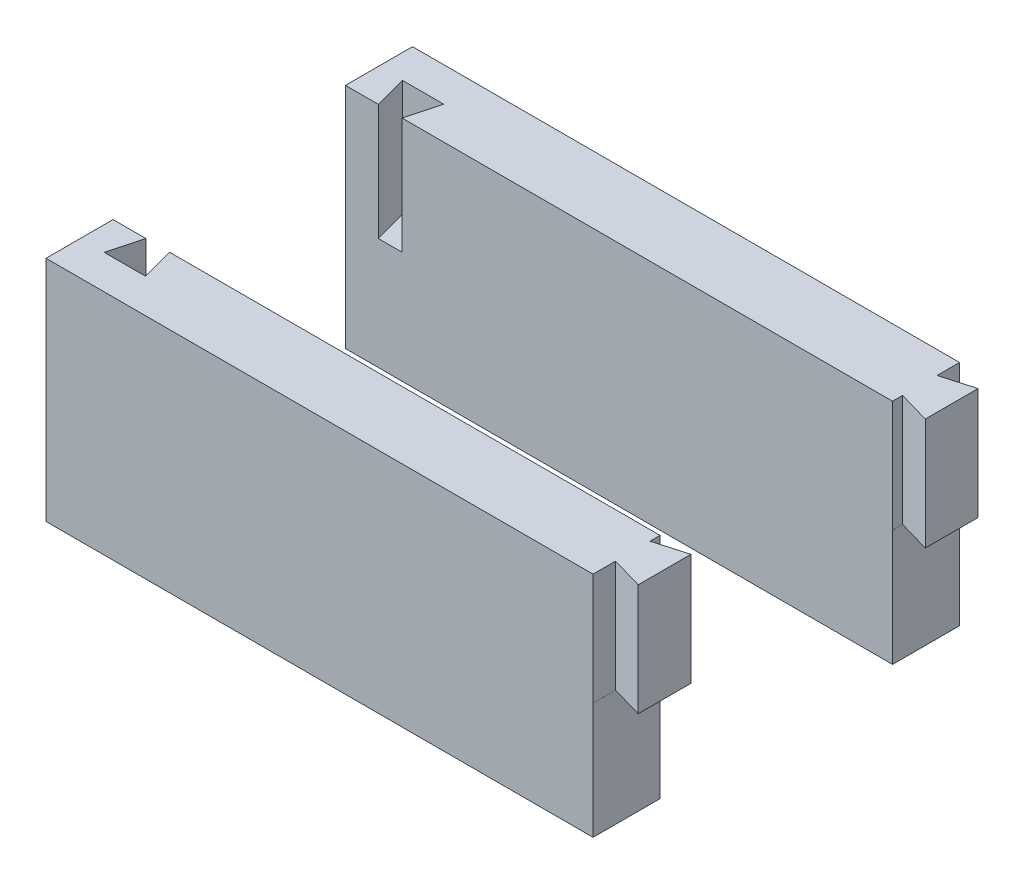
ISO-10303-21;
HEADER;
FILE_DESCRIPTION(('STEP AP214'),'2;1');
FILE_NAME('part.step','',(''),(''),'','','');
FILE_SCHEMA(('AUTOMOTIVE_DESIGN { 1 0 10303 214 1 1 1 1 }'));
ENDSEC;
DATA;
#1=APPLICATION_CONTEXT('core data for automotive mechanical design processes');
#2=APPLICATION_PROTOCOL_DEFINITION('international standard','automotive_design',2000,#1);
#3=PRODUCT_CONTEXT('',#1,'mechanical');
#4=PRODUCT('Part','Part','',(#3));
#5=PRODUCT_RELATED_PRODUCT_CATEGORY('part','',(#4));
#6=PRODUCT_DEFINITION_FORMATION('','',#4);
#7=PRODUCT_DEFINITION_CONTEXT('part definition',#1,'design');
#8=PRODUCT_DEFINITION('design','',#6,#7);
#9=PRODUCT_DEFINITION_SHAPE('','',#8);
#10=(LENGTH_UNIT() NAMED_UNIT(*) SI_UNIT(.MILLI.,.METRE.));
#11=(NAMED_UNIT(*) PLANE_ANGLE_UNIT() SI_UNIT($,.RADIAN.));
#12=(NAMED_UNIT(*) SI_UNIT($,.STERADIAN.) SOLID_ANGLE_UNIT());
#13=UNCERTAINTY_MEASURE_WITH_UNIT(LENGTH_MEASURE(1.E-05),#10,'distance_accuracy_value','');
#14=(GEOMETRIC_REPRESENTATION_CONTEXT(3) GLOBAL_UNCERTAINTY_ASSIGNED_CONTEXT((#13)) GLOBAL_UNIT_ASSIGNED_CONTEXT((#10,
#11,#12)) REPRESENTATION_CONTEXT('',''));
#15=CARTESIAN_POINT('',(0.,0.,0.));
#16=DIRECTION('',(0.,0.,1.));
#17=DIRECTION('',(1.,0.,0.));
#18=AXIS2_PLACEMENT_3D('',#15,#16,#17);
#19=CARTESIAN_POINT('',(-60.9366197183099,28.612676056338,-67.));
#20=DIRECTION('',(1.,0.,0.));
#21=DIRECTION('',(0.,0.,1.));
#22=AXIS2_PLACEMENT_3D('',#19,#20,#21);
#23=PLANE('',#22);
#24=DIRECTION('',(0.,-1.,0.));
#25=VECTOR('',#24,1.);
#26=CARTESIAN_POINT('',(-60.9366197183099,28.612676056338,-52.));
#27=LINE('',#26,#25);
#28=CARTESIAN_POINT('',(-60.9366197183099,28.612676056338,-52.));
#29=VERTEX_POINT('',#28);
#30=CARTESIAN_POINT('',(-60.9366197183099,-22.387323943662,-52.));
#31=VERTEX_POINT('',#30);
#32=EDGE_CURVE('E283',#29,#31,#27,.T.);
#33=ORIENTED_EDGE('',*,*,#32,.F.);
#34=DIRECTION('',(0.,0.,1.));
#35=VECTOR('',#34,1.);
#36=CARTESIAN_POINT('',(-60.9366197183099,28.612676056338,-67.));
#37=LINE('',#36,#35);
#38=CARTESIAN_POINT('',(-60.9366197183099,28.612676056338,-67.));
#39=VERTEX_POINT('',#38);
#40=EDGE_CURVE('E299',#39,#29,#37,.T.);
#41=ORIENTED_EDGE('',*,*,#40,.F.);
#42=DIRECTION('',(0.,-1.,0.));
#43=VECTOR('',#42,1.);
#44=CARTESIAN_POINT('',(-60.9366197183099,28.612676056338,-67.));
#45=LINE('',#44,#43);
#46=CARTESIAN_POINT('',(-60.9366197183099,-22.387323943662,-67.));
#47=VERTEX_POINT('',#46);
#48=EDGE_CURVE('E287',#39,#47,#45,.T.);
#49=ORIENTED_EDGE('',*,*,#48,.T.);
#50=DIRECTION('',(0.,0.,1.));
#51=VECTOR('',#50,1.);
#52=CARTESIAN_POINT('',(-60.9366197183099,-22.387323943662,-67.));
#53=LINE('',#52,#51);
#54=EDGE_CURVE('E12',#47,#31,#53,.T.);
#55=ORIENTED_EDGE('',*,*,#54,.T.);
#56=EDGE_LOOP('',(#33,#41,#49,#55));
#57=FACE_BOUND('',#56,.T.);
#58=ADVANCED_FACE('F54',(#57),#23,.F.);
#59=CARTESIAN_POINT('',(-60.9366197183099,-22.387323943662,-67.));
#60=DIRECTION('',(0.,1.,0.));
#61=DIRECTION('',(0.,0.,-1.));
#62=AXIS2_PLACEMENT_3D('',#59,#60,#61);
#63=PLANE('',#62);
#64=DIRECTION('',(1.,0.,0.));
#65=VECTOR('',#64,1.);
#66=CARTESIAN_POINT('',(-60.9366197183099,-22.387323943662,-52.));
#67=LINE('',#66,#65);
#68=CARTESIAN_POINT('',(61.4533802816902,-22.387323943662,-52.));
#69=VERTEX_POINT('',#68);
#70=EDGE_CURVE('E179',#31,#69,#67,.T.);
#71=ORIENTED_EDGE('',*,*,#70,.F.);
#72=ORIENTED_EDGE('',*,*,#54,.F.);
#73=DIRECTION('',(1.,0.,0.));
#74=VECTOR('',#73,1.);
#75=CARTESIAN_POINT('',(-60.9366197183099,-22.387323943662,-67.));
#76=LINE('',#75,#74);
#77=CARTESIAN_POINT('',(61.4533802816902,-22.387323943662,-67.));
#78=VERTEX_POINT('',#77);
#79=EDGE_CURVE('E291',#47,#78,#76,.T.);
#80=ORIENTED_EDGE('',*,*,#79,.T.);
#81=DIRECTION('',(0.,0.,1.));
#82=VECTOR('',#81,1.);
#83=CARTESIAN_POINT('',(61.4533802816902,-22.387323943662,-52.));
#84=LINE('',#83,#82);
#85=EDGE_CURVE('E170',#78,#69,#84,.T.);
#86=ORIENTED_EDGE('',*,*,#85,.T.);
#87=EDGE_LOOP('',(#71,#72,#80,#86));
#88=FACE_BOUND('',#87,.T.);
#89=ADVANCED_FACE('F359',(#88),#63,.F.);
#90=CARTESIAN_POINT('',(68.5633802816901,28.612676056338,-67.));
#91=DIRECTION('',(-1.,0.,0.));
#92=DIRECTION('',(0.,0.,-1.));
#93=AXIS2_PLACEMENT_3D('',#90,#91,#92);
#94=PLANE('',#93);
#95=DIRECTION('',(0.,1.,0.));
#96=VECTOR('',#95,1.);
#97=CARTESIAN_POINT('',(68.5633802816901,3.61267605633802,-64.0102835669542));
#98=LINE('',#97,#96);
#99=CARTESIAN_POINT('',(68.5633802816901,3.61267605633802,-64.0102835669542));
#100=VERTEX_POINT('',#99);
#101=CARTESIAN_POINT('',(68.5633802816901,28.612676056338,-64.0102835669542));
#102=VERTEX_POINT('',#101);
#103=EDGE_CURVE('E215',#100,#102,#98,.T.);
#104=ORIENTED_EDGE('',*,*,#103,.T.);
#105=DIRECTION('',(0.,0.,1.));
#106=VECTOR('',#105,1.);
#107=CARTESIAN_POINT('',(68.5633802816901,28.612676056338,-67.));
#108=LINE('',#107,#106);
#109=CARTESIAN_POINT('',(68.5633802816901,28.612676056338,-52.2102835669542));
#110=VERTEX_POINT('',#109);
#111=EDGE_CURVE('E62',#102,#110,#108,.T.);
#112=ORIENTED_EDGE('',*,*,#111,.T.);
#113=DIRECTION('',(0.,1.,0.));
#114=VECTOR('',#113,1.);
#115=CARTESIAN_POINT('',(68.5633802816901,3.61267605633802,-52.2102835669542));
#116=LINE('',#115,#114);
#117=CARTESIAN_POINT('',(68.5633802816901,3.61267605633802,-52.2102835669542));
#118=VERTEX_POINT('',#117);
#119=EDGE_CURVE('E194',#118,#110,#116,.T.);
#120=ORIENTED_EDGE('',*,*,#119,.F.);
#121=DIRECTION('',(0.,0.,-1.));
#122=VECTOR('',#121,1.);
#123=CARTESIAN_POINT('',(68.5633802816901,3.61267605633802,-52.));
#124=LINE('',#123,#122);
#125=EDGE_CURVE('E182',#118,#100,#124,.T.);
#126=ORIENTED_EDGE('',*,*,#125,.T.);
#127=EDGE_LOOP('',(#104,#112,#120,#126));
#128=FACE_BOUND('',#127,.T.);
#129=ADVANCED_FACE('F315',(#128),#94,.F.);
#130=CARTESIAN_POINT('',(-60.9366197183099,28.612676056338,-67.));
#131=DIRECTION('',(0.,-1.,0.));
#132=DIRECTION('',(0.,0.,1.));
#133=AXIS2_PLACEMENT_3D('',#130,#131,#132);
#134=PLANE('',#133);
#135=DIRECTION('',(0.961261695938318,0.,0.275637355817002));
#136=VECTOR('',#135,1.);
#137=CARTESIAN_POINT('',(68.5633802816901,28.612676056338,-52.2102835669542));
#138=LINE('',#137,#136);
#139=CARTESIAN_POINT('',(61.4500437317466,28.612676056338,-54.25));
#140=VERTEX_POINT('',#139);
#141=EDGE_CURVE('E204',#140,#110,#138,.T.);
#142=ORIENTED_EDGE('',*,*,#141,.T.);
#143=ORIENTED_EDGE('',*,*,#111,.F.);
#144=DIRECTION('',(-0.961261695938318,0.,0.275637355817003));
#145=VECTOR('',#144,1.);
#146=CARTESIAN_POINT('',(61.4500437317466,28.612676056338,-61.9705671339084));
#147=LINE('',#146,#145);
#148=CARTESIAN_POINT('',(61.4500437317466,28.612676056338,-61.9705671339084));
#149=VERTEX_POINT('',#148);
#150=EDGE_CURVE('E205',#102,#149,#147,.T.);
#151=ORIENTED_EDGE('',*,*,#150,.T.);
#152=DIRECTION('',(0.,0.,-1.));
#153=VECTOR('',#152,1.);
#154=CARTESIAN_POINT('',(61.4500437317466,28.612676056338,-67.));
#155=LINE('',#154,#153);
#156=CARTESIAN_POINT('',(61.4500437317466,28.612676056338,-67.));
#157=VERTEX_POINT('',#156);
#158=EDGE_CURVE('E226',#149,#157,#155,.T.);
#159=ORIENTED_EDGE('',*,*,#158,.T.);
#160=DIRECTION('',(-1.,0.,0.));
#161=VECTOR('',#160,1.);
#162=CARTESIAN_POINT('',(-60.9366197183099,28.612676056338,-67.));
#163=LINE('',#162,#161);
#164=EDGE_CURVE('E296',#157,#39,#163,.T.);
#165=ORIENTED_EDGE('',*,*,#164,.T.);
#166=ORIENTED_EDGE('',*,*,#40,.T.);
#167=DIRECTION('',(-1.,0.,0.));
#168=VECTOR('',#167,1.);
#169=CARTESIAN_POINT('',(-60.9366197183099,28.612676056338,-52.));
#170=LINE('',#169,#168);
#171=CARTESIAN_POINT('',(-53.5866197183098,28.612676056338,-52.));
#172=VERTEX_POINT('',#171);
#173=EDGE_CURVE('E304',#172,#29,#170,.T.);
#174=ORIENTED_EDGE('',*,*,#173,.F.);
#175=DIRECTION('',(0.258819045102518,0.,0.965925826289069));
#176=VECTOR('',#175,1.);
#177=CARTESIAN_POINT('',(-53.5866197183098,28.612676056338,-52.));
#178=LINE('',#177,#176);
#179=CARTESIAN_POINT('',(-55.553644461089,28.612676056338,-59.3410362797969));
#180=VERTEX_POINT('',#179);
#181=EDGE_CURVE('E253',#180,#172,#178,.T.);
#182=ORIENTED_EDGE('',*,*,#181,.F.);
#183=DIRECTION('',(-1.,0.,0.));
#184=VECTOR('',#183,1.);
#185=CARTESIAN_POINT('',(-55.553644461089,28.612676056338,-59.3410362797969));
#186=LINE('',#185,#184);
#187=CARTESIAN_POINT('',(-46.3195949755307,28.612676056338,-59.3410362797969));
#188=VERTEX_POINT('',#187);
#189=EDGE_CURVE('E261',#188,#180,#186,.T.);
#190=ORIENTED_EDGE('',*,*,#189,.F.);
#191=DIRECTION('',(0.258819045102518,0.,-0.965925826289069));
#192=VECTOR('',#191,1.);
#193=CARTESIAN_POINT('',(-46.3195949755307,28.612676056338,-59.3410362797969));
#194=LINE('',#193,#192);
#195=CARTESIAN_POINT('',(-48.2866197183099,28.612676056338,-52.));
#196=VERTEX_POINT('',#195);
#197=EDGE_CURVE('E257',#196,#188,#194,.T.);
#198=ORIENTED_EDGE('',*,*,#197,.F.);
#199=CARTESIAN_POINT('',(61.4500437317466,28.612676056338,-52.));
#200=VERTEX_POINT('',#199);
#201=EDGE_CURVE('E292',#200,#196,#170,.T.);
#202=ORIENTED_EDGE('',*,*,#201,.F.);
#203=DIRECTION('',(0.,0.,-1.));
#204=VECTOR('',#203,1.);
#205=CARTESIAN_POINT('',(61.4500437317466,28.612676056338,-54.25));
#206=LINE('',#205,#204);
#207=EDGE_CURVE('E200',#200,#140,#206,.T.);
#208=ORIENTED_EDGE('',*,*,#207,.T.);
#209=EDGE_LOOP('',(#142,#143,#151,#159,#165,#166,#174,#182,#190,#198,#202,#208));
#210=FACE_BOUND('',#209,.T.);
#211=ADVANCED_FACE('F319',(#210),#134,.F.);
#212=CARTESIAN_POINT('',(0.,0.,-67.));
#213=DIRECTION('',(0.,0.,-1.));
#214=DIRECTION('',(1.,0.,0.));
#215=AXIS2_PLACEMENT_3D('',#212,#213,#214);
#216=PLANE('',#215);
#217=DIRECTION('',(0.,-1.,0.));
#218=VECTOR('',#217,1.);
#219=CARTESIAN_POINT('',(61.4533802816902,3.61267605633802,-67.));
#220=LINE('',#219,#218);
#221=CARTESIAN_POINT('',(61.4533802816902,3.61267605633802,-67.));
#222=VERTEX_POINT('',#221);
#223=EDGE_CURVE('E181',#222,#78,#220,.T.);
#224=ORIENTED_EDGE('',*,*,#223,.T.);
#225=ORIENTED_EDGE('',*,*,#79,.F.);
#226=ORIENTED_EDGE('',*,*,#48,.F.);
#227=ORIENTED_EDGE('',*,*,#164,.F.);
#228=DIRECTION('',(0.,1.,0.));
#229=VECTOR('',#228,1.);
#230=CARTESIAN_POINT('',(61.4500437317466,3.61267605633802,-67.));
#231=LINE('',#230,#229);
#232=CARTESIAN_POINT('',(61.4500437317466,3.61267605633802,-67.));
#233=VERTEX_POINT('',#232);
#234=EDGE_CURVE('E222',#233,#157,#231,.T.);
#235=ORIENTED_EDGE('',*,*,#234,.F.);
#236=DIRECTION('',(1.,0.,0.));
#237=VECTOR('',#236,1.);
#238=CARTESIAN_POINT('',(68.5633802816901,3.61267605633802,-67.));
#239=LINE('',#238,#237);
#240=EDGE_CURVE('E230',#233,#222,#239,.T.);
#241=ORIENTED_EDGE('',*,*,#240,.T.);
#242=EDGE_LOOP('',(#224,#225,#226,#227,#235,#241));
#243=FACE_BOUND('',#242,.T.);
#244=ADVANCED_FACE('F363',(#243),#216,.T.);
#245=CARTESIAN_POINT('',(0.,0.,-52.));
#246=DIRECTION('',(0.,0.,-1.));
#247=DIRECTION('',(1.,0.,0.));
#248=AXIS2_PLACEMENT_3D('',#245,#246,#247);
#249=PLANE('',#248);
#250=DIRECTION('',(-1.,0.,0.));
#251=VECTOR('',#250,1.);
#252=CARTESIAN_POINT('',(61.4500437317466,3.61267605633802,-52.));
#253=LINE('',#252,#251);
#254=CARTESIAN_POINT('',(61.4533802816902,3.61267605633802,-52.));
#255=VERTEX_POINT('',#254);
#256=CARTESIAN_POINT('',(61.4500437317466,3.61267605633802,-52.));
#257=VERTEX_POINT('',#256);
#258=EDGE_CURVE('E177',#255,#257,#253,.T.);
#259=ORIENTED_EDGE('',*,*,#258,.T.);
#260=DIRECTION('',(0.,1.,0.));
#261=VECTOR('',#260,1.);
#262=CARTESIAN_POINT('',(61.4500437317466,3.61267605633802,-52.));
#263=LINE('',#262,#261);
#264=EDGE_CURVE('E208',#257,#200,#263,.T.);
#265=ORIENTED_EDGE('',*,*,#264,.T.);
#266=ORIENTED_EDGE('',*,*,#201,.T.);
#267=DIRECTION('',(0.,-1.,0.));
#268=VECTOR('',#267,1.);
#269=CARTESIAN_POINT('',(-48.2866197183099,267.34593418408,-52.));
#270=LINE('',#269,#268);
#271=CARTESIAN_POINT('',(-48.2866197183099,2.61267605633802,-52.));
#272=VERTEX_POINT('',#271);
#273=EDGE_CURVE('E275',#196,#272,#270,.T.);
#274=ORIENTED_EDGE('',*,*,#273,.T.);
#275=DIRECTION('',(-1.,0.,0.));
#276=VECTOR('',#275,1.);
#277=CARTESIAN_POINT('',(-60.9366197183099,2.61267605633802,-52.));
#278=LINE('',#277,#276);
#279=CARTESIAN_POINT('',(-53.5866197183098,2.61267605633802,-52.));
#280=VERTEX_POINT('',#279);
#281=EDGE_CURVE('E211',#272,#280,#278,.T.);
#282=ORIENTED_EDGE('',*,*,#281,.T.);
#283=DIRECTION('',(0.,-1.,0.));
#284=VECTOR('',#283,1.);
#285=CARTESIAN_POINT('',(-53.5866197183098,267.34593418408,-52.));
#286=LINE('',#285,#284);
#287=EDGE_CURVE('E248',#172,#280,#286,.T.);
#288=ORIENTED_EDGE('',*,*,#287,.F.);
#289=ORIENTED_EDGE('',*,*,#173,.T.);
#290=ORIENTED_EDGE('',*,*,#32,.T.);
#291=ORIENTED_EDGE('',*,*,#70,.T.);
#292=DIRECTION('',(0.,-1.,0.));
#293=VECTOR('',#292,1.);
#294=CARTESIAN_POINT('',(61.4533802816902,3.61267605633802,-52.));
#295=LINE('',#294,#293);
#296=EDGE_CURVE('E165',#255,#69,#295,.T.);
#297=ORIENTED_EDGE('',*,*,#296,.F.);
#298=EDGE_LOOP('',(#259,#265,#266,#274,#282,#288,#289,#290,#291,#297));
#299=FACE_BOUND('',#298,.T.);
#300=ADVANCED_FACE('F176',(#299),#249,.F.);
#301=CARTESIAN_POINT('',(-46.3195949755307,267.34593418408,-59.3410362797969));
#302=DIRECTION('',(-0.965925826289069,0.,-0.258819045102518));
#303=DIRECTION('',(0.258819045102518,0.,-0.965925826289069));
#304=AXIS2_PLACEMENT_3D('',#301,#302,#303);
#305=PLANE('',#304);
#306=ORIENTED_EDGE('',*,*,#197,.T.);
#307=DIRECTION('',(0.,-1.,0.));
#308=VECTOR('',#307,1.);
#309=CARTESIAN_POINT('',(-46.3195949755307,267.34593418408,-59.3410362797969));
#310=LINE('',#309,#308);
#311=CARTESIAN_POINT('',(-46.3195949755307,2.61267605633802,-59.3410362797969));
#312=VERTEX_POINT('',#311);
#313=EDGE_CURVE('E279',#188,#312,#310,.T.);
#314=ORIENTED_EDGE('',*,*,#313,.T.);
#315=DIRECTION('',(0.258819045102518,0.,-0.965925826289069));
#316=VECTOR('',#315,1.);
#317=CARTESIAN_POINT('',(-46.3195949755307,2.61267605633803,-59.3410362797969));
#318=LINE('',#317,#316);
#319=EDGE_CURVE('E244',#272,#312,#318,.T.);
#320=ORIENTED_EDGE('',*,*,#319,.F.);
#321=ORIENTED_EDGE('',*,*,#273,.F.);
#322=EDGE_LOOP('',(#306,#314,#320,#321));
#323=FACE_BOUND('',#322,.T.);
#324=ADVANCED_FACE('F344',(#323),#305,.T.);
#325=CARTESIAN_POINT('',(-55.553644461089,267.34593418408,-59.3410362797969));
#326=DIRECTION('',(0.,0.,1.));
#327=DIRECTION('',(-1.,0.,0.));
#328=AXIS2_PLACEMENT_3D('',#325,#326,#327);
#329=PLANE('',#328);
#330=ORIENTED_EDGE('',*,*,#189,.T.);
#331=DIRECTION('',(0.,-1.,0.));
#332=VECTOR('',#331,1.);
#333=CARTESIAN_POINT('',(-55.553644461089,267.34593418408,-59.3410362797969));
#334=LINE('',#333,#332);
#335=CARTESIAN_POINT('',(-55.553644461089,2.61267605633802,-59.3410362797969));
#336=VERTEX_POINT('',#335);
#337=EDGE_CURVE('E271',#180,#336,#334,.T.);
#338=ORIENTED_EDGE('',*,*,#337,.T.);
#339=DIRECTION('',(-1.,0.,0.));
#340=VECTOR('',#339,1.);
#341=CARTESIAN_POINT('',(-55.553644461089,2.61267605633803,-59.3410362797969));
#342=LINE('',#341,#340);
#343=EDGE_CURVE('E249',#312,#336,#342,.T.);
#344=ORIENTED_EDGE('',*,*,#343,.F.);
#345=ORIENTED_EDGE('',*,*,#313,.F.);
#346=EDGE_LOOP('',(#330,#338,#344,#345));
#347=FACE_BOUND('',#346,.T.);
#348=ADVANCED_FACE('F400',(#347),#329,.T.);
#349=CARTESIAN_POINT('',(-53.5866197183098,267.34593418408,-52.));
#350=DIRECTION('',(0.965925826289069,0.,-0.258819045102518));
#351=DIRECTION('',(0.258819045102518,0.,0.965925826289069));
#352=AXIS2_PLACEMENT_3D('',#349,#350,#351);
#353=PLANE('',#352);
#354=ORIENTED_EDGE('',*,*,#181,.T.);
#355=ORIENTED_EDGE('',*,*,#287,.T.);
#356=DIRECTION('',(0.258819045102518,0.,0.965925826289069));
#357=VECTOR('',#356,1.);
#358=CARTESIAN_POINT('',(-53.5866197183098,2.61267605633803,-52.));
#359=LINE('',#358,#357);
#360=EDGE_CURVE('E250',#336,#280,#359,.T.);
#361=ORIENTED_EDGE('',*,*,#360,.F.);
#362=ORIENTED_EDGE('',*,*,#337,.F.);
#363=EDGE_LOOP('',(#354,#355,#361,#362));
#364=FACE_BOUND('',#363,.T.);
#365=ADVANCED_FACE('F350',(#364),#353,.T.);
#366=CARTESIAN_POINT('',(-60.9366197183099,2.61267605633802,-67.));
#367=DIRECTION('',(0.,-1.,0.));
#368=DIRECTION('',(0.,0.,1.));
#369=AXIS2_PLACEMENT_3D('',#366,#367,#368);
#370=PLANE('',#369);
#371=ORIENTED_EDGE('',*,*,#281,.F.);
#372=ORIENTED_EDGE('',*,*,#319,.T.);
#373=ORIENTED_EDGE('',*,*,#343,.T.);
#374=ORIENTED_EDGE('',*,*,#360,.T.);
#375=EDGE_LOOP('',(#371,#372,#373,#374));
#376=FACE_BOUND('',#375,.T.);
#377=ADVANCED_FACE('F347',(#376),#370,.F.);
#378=CARTESIAN_POINT('',(61.4500437317466,3.61267605633802,-54.25));
#379=DIRECTION('',(-1.,0.,0.));
#380=DIRECTION('',(0.,0.,-1.));
#381=AXIS2_PLACEMENT_3D('',#378,#379,#380);
#382=PLANE('',#381);
#383=ORIENTED_EDGE('',*,*,#207,.F.);
#384=ORIENTED_EDGE('',*,*,#264,.F.);
#385=DIRECTION('',(0.,0.,-1.));
#386=VECTOR('',#385,1.);
#387=CARTESIAN_POINT('',(61.4500437317466,3.61267605633802,-54.25));
#388=LINE('',#387,#386);
#389=CARTESIAN_POINT('',(61.4500437317466,3.61267605633802,-54.25));
#390=VERTEX_POINT('',#389);
#391=EDGE_CURVE('E186',#257,#390,#388,.T.);
#392=ORIENTED_EDGE('',*,*,#391,.T.);
#393=DIRECTION('',(0.,1.,0.));
#394=VECTOR('',#393,1.);
#395=CARTESIAN_POINT('',(61.4500437317466,3.61267605633802,-54.25));
#396=LINE('',#395,#394);
#397=EDGE_CURVE('E189',#390,#140,#396,.T.);
#398=ORIENTED_EDGE('',*,*,#397,.T.);
#399=EDGE_LOOP('',(#383,#384,#392,#398));
#400=FACE_BOUND('',#399,.T.);
#401=ADVANCED_FACE('F339',(#400),#382,.F.);
#402=CARTESIAN_POINT('',(68.5633802816901,3.61267605633802,-52.2102835669542));
#403=DIRECTION('',(0.275637355817002,0.,-0.961261695938318));
#404=DIRECTION('',(0.961261695938318,0.,0.275637355817002));
#405=AXIS2_PLACEMENT_3D('',#402,#403,#404);
#406=PLANE('',#405);
#407=ORIENTED_EDGE('',*,*,#141,.F.);
#408=ORIENTED_EDGE('',*,*,#397,.F.);
#409=DIRECTION('',(0.961261695938318,0.,0.275637355817002));
#410=VECTOR('',#409,1.);
#411=CARTESIAN_POINT('',(68.5633802816901,3.61267605633802,-52.2102835669542));
#412=LINE('',#411,#410);
#413=CARTESIAN_POINT('',(61.4533802816902,3.61267605633802,-54.2490432596993));
#414=VERTEX_POINT('',#413);
#415=EDGE_CURVE('E190',#390,#414,#412,.T.);
#416=ORIENTED_EDGE('',*,*,#415,.T.);
#417=DIRECTION('',(-0.961261695938318,0.,-0.275637355817002));
#418=VECTOR('',#417,1.);
#419=CARTESIAN_POINT('',(68.5633802816901,3.61267605633802,-52.2102835669542));
#420=LINE('',#419,#418);
#421=EDGE_CURVE('E225',#118,#414,#420,.T.);
#422=ORIENTED_EDGE('',*,*,#421,.F.);
#423=ORIENTED_EDGE('',*,*,#119,.T.);
#424=EDGE_LOOP('',(#407,#408,#416,#422,#423));
#425=FACE_BOUND('',#424,.T.);
#426=ADVANCED_FACE('F325',(#425),#406,.F.);
#427=CARTESIAN_POINT('',(0.,3.61267605633802,-52.));
#428=DIRECTION('',(0.,-1.,0.));
#429=DIRECTION('',(0.,0.,1.));
#430=AXIS2_PLACEMENT_3D('',#427,#428,#429);
#431=PLANE('',#430);
#432=ORIENTED_EDGE('',*,*,#415,.F.);
#433=ORIENTED_EDGE('',*,*,#391,.F.);
#434=ORIENTED_EDGE('',*,*,#258,.F.);
#435=DIRECTION('',(0.,0.,1.));
#436=VECTOR('',#435,1.);
#437=CARTESIAN_POINT('',(61.4533802816902,3.61267605633802,-52.));
#438=LINE('',#437,#436);
#439=EDGE_CURVE('E161',#414,#255,#438,.T.);
#440=ORIENTED_EDGE('',*,*,#439,.F.);
#441=EDGE_LOOP('',(#432,#433,#434,#440));
#442=FACE_BOUND('',#441,.T.);
#443=ADVANCED_FACE('F184',(#442),#431,.F.);
#444=CARTESIAN_POINT('',(61.4500437317466,3.61267605633802,-67.));
#445=DIRECTION('',(-1.,0.,0.));
#446=DIRECTION('',(0.,0.,-1.));
#447=AXIS2_PLACEMENT_3D('',#444,#445,#446);
#448=PLANE('',#447);
#449=ORIENTED_EDGE('',*,*,#158,.F.);
#450=DIRECTION('',(0.,1.,0.));
#451=VECTOR('',#450,1.);
#452=CARTESIAN_POINT('',(61.4500437317466,3.61267605633802,-61.9705671339084));
#453=LINE('',#452,#451);
#454=CARTESIAN_POINT('',(61.4500437317466,3.61267605633802,-61.9705671339084));
#455=VERTEX_POINT('',#454);
#456=EDGE_CURVE('E219',#455,#149,#453,.T.);
#457=ORIENTED_EDGE('',*,*,#456,.F.);
#458=DIRECTION('',(0.,0.,-1.));
#459=VECTOR('',#458,1.);
#460=CARTESIAN_POINT('',(61.4500437317466,3.61267605633802,-67.));
#461=LINE('',#460,#459);
#462=EDGE_CURVE('E77',#455,#233,#461,.T.);
#463=ORIENTED_EDGE('',*,*,#462,.T.);
#464=ORIENTED_EDGE('',*,*,#234,.T.);
#465=EDGE_LOOP('',(#449,#457,#463,#464));
#466=FACE_BOUND('',#465,.T.);
#467=ADVANCED_FACE('F371',(#466),#448,.F.);
#468=CARTESIAN_POINT('',(61.4500437317466,3.61267605633802,-61.9705671339084));
#469=DIRECTION('',(0.275637355817003,0.,0.961261695938318));
#470=DIRECTION('',(-0.961261695938318,0.,0.275637355817003));
#471=AXIS2_PLACEMENT_3D('',#468,#469,#470);
#472=PLANE('',#471);
#473=ORIENTED_EDGE('',*,*,#150,.F.);
#474=ORIENTED_EDGE('',*,*,#103,.F.);
#475=DIRECTION('',(-0.961261695938318,0.,0.275637355817003));
#476=VECTOR('',#475,1.);
#477=CARTESIAN_POINT('',(61.4500437317466,3.61267605633802,-61.9705671339084));
#478=LINE('',#477,#476);
#479=CARTESIAN_POINT('',(61.4533802816902,3.61267605633802,-61.971523874209));
#480=VERTEX_POINT('',#479);
#481=EDGE_CURVE('E237',#100,#480,#478,.T.);
#482=ORIENTED_EDGE('',*,*,#481,.T.);
#483=EDGE_CURVE('E236',#480,#455,#478,.T.);
#484=ORIENTED_EDGE('',*,*,#483,.T.);
#485=ORIENTED_EDGE('',*,*,#456,.T.);
#486=EDGE_LOOP('',(#473,#474,#482,#484,#485));
#487=FACE_BOUND('',#486,.T.);
#488=ADVANCED_FACE('F369',(#487),#472,.F.);
#489=CARTESIAN_POINT('',(0.,3.61267605633802,-52.));
#490=DIRECTION('',(0.,-1.,0.));
#491=DIRECTION('',(0.,0.,1.));
#492=AXIS2_PLACEMENT_3D('',#489,#490,#491);
#493=PLANE('',#492);
#494=ORIENTED_EDGE('',*,*,#240,.F.);
#495=ORIENTED_EDGE('',*,*,#462,.F.);
#496=ORIENTED_EDGE('',*,*,#483,.F.);
#497=EDGE_CURVE('E172',#222,#480,#438,.T.);
#498=ORIENTED_EDGE('',*,*,#497,.F.);
#499=EDGE_LOOP('',(#494,#495,#496,#498));
#500=FACE_BOUND('',#499,.T.);
#501=ADVANCED_FACE('F366',(#500),#493,.F.);
#502=CARTESIAN_POINT('',(0.,3.61267605633802,-52.));
#503=DIRECTION('',(0.,1.,0.));
#504=DIRECTION('',(0.,0.,-1.));
#505=AXIS2_PLACEMENT_3D('',#502,#503,#504);
#506=PLANE('',#505);
#507=ORIENTED_EDGE('',*,*,#125,.F.);
#508=ORIENTED_EDGE('',*,*,#421,.T.);
#509=EDGE_CURVE('E69',#480,#414,#438,.T.);
#510=ORIENTED_EDGE('',*,*,#509,.F.);
#511=ORIENTED_EDGE('',*,*,#481,.F.);
#512=EDGE_LOOP('',(#507,#508,#510,#511));
#513=FACE_BOUND('',#512,.T.);
#514=ADVANCED_FACE('F329',(#513),#506,.F.);
#515=CARTESIAN_POINT('',(61.4533802816902,3.61267605633802,-52.));
#516=DIRECTION('',(-1.,0.,0.));
#517=DIRECTION('',(0.,0.,-1.));
#518=AXIS2_PLACEMENT_3D('',#515,#516,#517);
#519=PLANE('',#518);
#520=ORIENTED_EDGE('',*,*,#85,.F.);
#521=ORIENTED_EDGE('',*,*,#223,.F.);
#522=ORIENTED_EDGE('',*,*,#497,.T.);
#523=ORIENTED_EDGE('',*,*,#509,.T.);
#524=ORIENTED_EDGE('',*,*,#439,.T.);
#525=ORIENTED_EDGE('',*,*,#296,.T.);
#526=EDGE_LOOP('',(#520,#521,#522,#523,#524,#525));
#527=FACE_BOUND('',#526,.T.);
#528=ADVANCED_FACE('F164',(#527),#519,.F.);
#529=CLOSED_SHELL('',(#58,#89,#129,#211,#244,#300,#324,#348,#365,#377,#401,#426,#443,#467,#488,
#501,#514,#528));
#530=MANIFOLD_SOLID_BREP('B2',#529);
#531=CARTESIAN_POINT('',(-60.9366197183099,28.612676056338,15.));
#532=DIRECTION('',(1.,0.,0.));
#533=DIRECTION('',(0.,0.,-1.));
#534=AXIS2_PLACEMENT_3D('',#531,#532,#533);
#535=PLANE('',#534);
#536=DIRECTION('',(0.,-1.,0.));
#537=VECTOR('',#536,1.);
#538=CARTESIAN_POINT('',(-60.9366197183099,28.612676056338,0.));
#539=LINE('',#538,#537);
#540=CARTESIAN_POINT('',(-60.9366197183099,28.612676056338,0.));
#541=VERTEX_POINT('',#540);
#542=CARTESIAN_POINT('',(-60.9366197183099,-22.387323943662,0.));
#543=VERTEX_POINT('',#542);
#544=EDGE_CURVE('E754',#541,#543,#539,.T.);
#545=ORIENTED_EDGE('',*,*,#544,.T.);
#546=DIRECTION('',(0.,0.,-1.));
#547=VECTOR('',#546,1.);
#548=CARTESIAN_POINT('',(-60.9366197183099,-22.387323943662,15.));
#549=LINE('',#548,#547);
#550=CARTESIAN_POINT('',(-60.9366197183099,-22.387323943662,15.));
#551=VERTEX_POINT('',#550);
#552=EDGE_CURVE('E52',#551,#543,#549,.T.);
#553=ORIENTED_EDGE('',*,*,#552,.F.);
#554=DIRECTION('',(0.,-1.,0.));
#555=VECTOR('',#554,1.);
#556=CARTESIAN_POINT('',(-60.9366197183099,28.612676056338,15.));
#557=LINE('',#556,#555);
#558=CARTESIAN_POINT('',(-60.9366197183099,28.612676056338,15.));
#559=VERTEX_POINT('',#558);
#560=EDGE_CURVE('E756',#559,#551,#557,.T.);
#561=ORIENTED_EDGE('',*,*,#560,.F.);
#562=DIRECTION('',(0.,0.,-1.));
#563=VECTOR('',#562,1.);
#564=CARTESIAN_POINT('',(-60.9366197183099,28.612676056338,15.));
#565=LINE('',#564,#563);
#566=EDGE_CURVE('E765',#559,#541,#565,.T.);
#567=ORIENTED_EDGE('',*,*,#566,.T.);
#568=EDGE_LOOP('',(#545,#553,#561,#567));
#569=FACE_BOUND('',#568,.T.);
#570=ADVANCED_FACE('F557',(#569),#535,.F.);
#571=CARTESIAN_POINT('',(-60.9366197183099,-22.387323943662,15.));
#572=DIRECTION('',(0.,1.,0.));
#573=DIRECTION('',(0.,0.,1.));
#574=AXIS2_PLACEMENT_3D('',#571,#572,#573);
#575=PLANE('',#574);
#576=DIRECTION('',(1.,0.,0.));
#577=VECTOR('',#576,1.);
#578=CARTESIAN_POINT('',(-60.9366197183099,-22.387323943662,0.));
#579=LINE('',#578,#577);
#580=CARTESIAN_POINT('',(61.4533802816902,-22.387323943662,0.));
#581=VERTEX_POINT('',#580);
#582=EDGE_CURVE('E767',#543,#581,#579,.T.);
#583=ORIENTED_EDGE('',*,*,#582,.T.);
#584=DIRECTION('',(0.,0.,-1.));
#585=VECTOR('',#584,1.);
#586=CARTESIAN_POINT('',(61.4533802816902,-22.387323943662,0.));
#587=LINE('',#586,#585);
#588=CARTESIAN_POINT('',(61.4533802816902,-22.387323943662,15.));
#589=VERTEX_POINT('',#588);
#590=EDGE_CURVE('E667',#589,#581,#587,.T.);
#591=ORIENTED_EDGE('',*,*,#590,.F.);
#592=DIRECTION('',(1.,0.,0.));
#593=VECTOR('',#592,1.);
#594=CARTESIAN_POINT('',(-60.9366197183099,-22.387323943662,15.));
#595=LINE('',#594,#593);
#596=EDGE_CURVE('E759',#551,#589,#595,.T.);
#597=ORIENTED_EDGE('',*,*,#596,.F.);
#598=ORIENTED_EDGE('',*,*,#552,.T.);
#599=EDGE_LOOP('',(#583,#591,#597,#598));
#600=FACE_BOUND('',#599,.T.);
#601=ADVANCED_FACE('F831',(#600),#575,.F.);
#602=CARTESIAN_POINT('',(68.5633802816901,28.612676056338,15.));
#603=DIRECTION('',(-1.,0.,0.));
#604=DIRECTION('',(0.,0.,1.));
#605=AXIS2_PLACEMENT_3D('',#602,#603,#604);
#606=PLANE('',#605);
#607=DIRECTION('',(0.,1.,0.));
#608=VECTOR('',#607,1.);
#609=CARTESIAN_POINT('',(68.5633802816901,3.61267605633802,12.0102835669542));
#610=LINE('',#609,#608);
#611=CARTESIAN_POINT('',(68.5633802816901,3.61267605633802,12.0102835669542));
#612=VERTEX_POINT('',#611);
#613=CARTESIAN_POINT('',(68.5633802816901,28.612676056338,12.0102835669542));
#614=VERTEX_POINT('',#613);
#615=EDGE_CURVE('E707',#612,#614,#610,.T.);
#616=ORIENTED_EDGE('',*,*,#615,.F.);
#617=DIRECTION('',(0.,0.,1.));
#618=VECTOR('',#617,1.);
#619=CARTESIAN_POINT('',(68.5633802816901,3.61267605633802,0.));
#620=LINE('',#619,#618);
#621=CARTESIAN_POINT('',(68.5633802816901,3.61267605633802,0.210283566954185));
#622=VERTEX_POINT('',#621);
#623=EDGE_CURVE('E673',#622,#612,#620,.T.);
#624=ORIENTED_EDGE('',*,*,#623,.F.);
#625=DIRECTION('',(0.,1.,0.));
#626=VECTOR('',#625,1.);
#627=CARTESIAN_POINT('',(68.5633802816901,3.61267605633802,0.210283566954185));
#628=LINE('',#627,#626);
#629=CARTESIAN_POINT('',(68.5633802816901,28.612676056338,0.210283566954185));
#630=VERTEX_POINT('',#629);
#631=EDGE_CURVE('E691',#622,#630,#628,.T.);
#632=ORIENTED_EDGE('',*,*,#631,.T.);
#633=DIRECTION('',(0.,0.,-1.));
#634=VECTOR('',#633,1.);
#635=CARTESIAN_POINT('',(68.5633802816901,28.612676056338,15.));
#636=LINE('',#635,#634);
#637=EDGE_CURVE('E564',#614,#630,#636,.T.);
#638=ORIENTED_EDGE('',*,*,#637,.F.);
#639=EDGE_LOOP('',(#616,#624,#632,#638));
#640=FACE_BOUND('',#639,.T.);
#641=ADVANCED_FACE('F782',(#640),#606,.F.);
#642=CARTESIAN_POINT('',(-60.9366197183099,28.612676056338,15.));
#643=DIRECTION('',(0.,-1.,0.));
#644=DIRECTION('',(0.,0.,-1.));
#645=AXIS2_PLACEMENT_3D('',#642,#643,#644);
#646=PLANE('',#645);
#647=DIRECTION('',(0.961261695938318,0.,-0.275637355817002));
#648=VECTOR('',#647,1.);
#649=CARTESIAN_POINT('',(68.5633802816901,28.612676056338,0.210283566954185));
#650=LINE('',#649,#648);
#651=CARTESIAN_POINT('',(61.4500437317466,28.612676056338,2.25));
#652=VERTEX_POINT('',#651);
#653=EDGE_CURVE('E700',#652,#630,#650,.T.);
#654=ORIENTED_EDGE('',*,*,#653,.F.);
#655=DIRECTION('',(0.,0.,1.));
#656=VECTOR('',#655,1.);
#657=CARTESIAN_POINT('',(61.4500437317466,28.612676056338,2.25));
#658=LINE('',#657,#656);
#659=CARTESIAN_POINT('',(61.4500437317466,28.612676056338,0.));
#660=VERTEX_POINT('',#659);
#661=EDGE_CURVE('E697',#660,#652,#658,.T.);
#662=ORIENTED_EDGE('',*,*,#661,.F.);
#663=DIRECTION('',(-1.,0.,0.));
#664=VECTOR('',#663,1.);
#665=CARTESIAN_POINT('',(-60.9366197183099,28.612676056338,0.));
#666=LINE('',#665,#664);
#667=CARTESIAN_POINT('',(-48.2866197183099,28.612676056338,0.));
#668=VERTEX_POINT('',#667);
#669=EDGE_CURVE('E760',#660,#668,#666,.T.);
#670=ORIENTED_EDGE('',*,*,#669,.T.);
#671=DIRECTION('',(0.258819045102518,0.,0.965925826289069));
#672=VECTOR('',#671,1.);
#673=CARTESIAN_POINT('',(-46.3195949755307,28.612676056338,7.34103627979693));
#674=LINE('',#673,#672);
#675=CARTESIAN_POINT('',(-46.3195949755307,28.612676056338,7.34103627979693));
#676=VERTEX_POINT('',#675);
#677=EDGE_CURVE('E736',#668,#676,#674,.T.);
#678=ORIENTED_EDGE('',*,*,#677,.T.);
#679=DIRECTION('',(-1.,0.,0.));
#680=VECTOR('',#679,1.);
#681=CARTESIAN_POINT('',(-55.553644461089,28.612676056338,7.34103627979693));
#682=LINE('',#681,#680);
#683=CARTESIAN_POINT('',(-55.553644461089,28.612676056338,7.34103627979693));
#684=VERTEX_POINT('',#683);
#685=EDGE_CURVE('E739',#676,#684,#682,.T.);
#686=ORIENTED_EDGE('',*,*,#685,.T.);
#687=DIRECTION('',(0.258819045102518,0.,-0.965925826289069));
#688=VECTOR('',#687,1.);
#689=CARTESIAN_POINT('',(-53.5866197183098,28.612676056338,0.));
#690=LINE('',#689,#688);
#691=CARTESIAN_POINT('',(-53.5866197183098,28.612676056338,0.));
#692=VERTEX_POINT('',#691);
#693=EDGE_CURVE('E733',#684,#692,#690,.T.);
#694=ORIENTED_EDGE('',*,*,#693,.T.);
#695=EDGE_CURVE('E769',#692,#541,#666,.T.);
#696=ORIENTED_EDGE('',*,*,#695,.T.);
#697=ORIENTED_EDGE('',*,*,#566,.F.);
#698=DIRECTION('',(-1.,0.,0.));
#699=VECTOR('',#698,1.);
#700=CARTESIAN_POINT('',(-60.9366197183099,28.612676056338,15.));
#701=LINE('',#700,#699);
#702=CARTESIAN_POINT('',(61.4500437317466,28.612676056338,15.));
#703=VERTEX_POINT('',#702);
#704=EDGE_CURVE('E763',#703,#559,#701,.T.);
#705=ORIENTED_EDGE('',*,*,#704,.F.);
#706=DIRECTION('',(0.,0.,1.));
#707=VECTOR('',#706,1.);
#708=CARTESIAN_POINT('',(61.4500437317466,28.612676056338,15.));
#709=LINE('',#708,#707);
#710=CARTESIAN_POINT('',(61.4500437317466,28.612676056338,9.97056713390836));
#711=VERTEX_POINT('',#710);
#712=EDGE_CURVE('E715',#711,#703,#709,.T.);
#713=ORIENTED_EDGE('',*,*,#712,.F.);
#714=DIRECTION('',(-0.961261695938318,0.,-0.275637355817003));
#715=VECTOR('',#714,1.);
#716=CARTESIAN_POINT('',(61.4500437317466,28.612676056338,9.97056713390836));
#717=LINE('',#716,#715);
#718=EDGE_CURVE('E701',#614,#711,#717,.T.);
#719=ORIENTED_EDGE('',*,*,#718,.F.);
#720=ORIENTED_EDGE('',*,*,#637,.T.);
#721=EDGE_LOOP('',(#654,#662,#670,#678,#686,#694,#696,#697,#705,#713,#719,#720));
#722=FACE_BOUND('',#721,.T.);
#723=ADVANCED_FACE('F777',(#722),#646,.F.);
#724=CARTESIAN_POINT('',(0.,0.,15.));
#725=DIRECTION('',(0.,0.,1.));
#726=DIRECTION('',(1.,0.,0.));
#727=AXIS2_PLACEMENT_3D('',#724,#725,#726);
#728=PLANE('',#727);
#729=DIRECTION('',(0.,-1.,0.));
#730=VECTOR('',#729,1.);
#731=CARTESIAN_POINT('',(61.4533802816902,3.61267605633802,15.));
#732=LINE('',#731,#730);
#733=CARTESIAN_POINT('',(61.4533802816902,3.61267605633802,15.));
#734=VERTEX_POINT('',#733);
#735=EDGE_CURVE('E672',#734,#589,#732,.T.);
#736=ORIENTED_EDGE('',*,*,#735,.F.);
#737=DIRECTION('',(1.,0.,0.));
#738=VECTOR('',#737,1.);
#739=CARTESIAN_POINT('',(68.5633802816901,3.61267605633802,15.));
#740=LINE('',#739,#738);
#741=CARTESIAN_POINT('',(61.4500437317466,3.61267605633802,15.));
#742=VERTEX_POINT('',#741);
#743=EDGE_CURVE('E717',#742,#734,#740,.T.);
#744=ORIENTED_EDGE('',*,*,#743,.F.);
#745=DIRECTION('',(0.,1.,0.));
#746=VECTOR('',#745,1.);
#747=CARTESIAN_POINT('',(61.4500437317466,3.61267605633802,15.));
#748=LINE('',#747,#746);
#749=EDGE_CURVE('E711',#742,#703,#748,.T.);
#750=ORIENTED_EDGE('',*,*,#749,.T.);
#751=ORIENTED_EDGE('',*,*,#704,.T.);
#752=ORIENTED_EDGE('',*,*,#560,.T.);
#753=ORIENTED_EDGE('',*,*,#596,.T.);
#754=EDGE_LOOP('',(#736,#744,#750,#751,#752,#753));
#755=FACE_BOUND('',#754,.T.);
#756=ADVANCED_FACE('F813',(#755),#728,.T.);
#757=CARTESIAN_POINT('',(0.,0.,0.));
#758=DIRECTION('',(0.,0.,1.));
#759=DIRECTION('',(1.,0.,0.));
#760=AXIS2_PLACEMENT_3D('',#757,#758,#759);
#761=PLANE('',#760);
#762=DIRECTION('',(-1.,0.,0.));
#763=VECTOR('',#762,1.);
#764=CARTESIAN_POINT('',(61.4500437317466,3.61267605633802,0.));
#765=LINE('',#764,#763);
#766=CARTESIAN_POINT('',(61.4533802816902,3.61267605633802,0.));
#767=VERTEX_POINT('',#766);
#768=CARTESIAN_POINT('',(61.4500437317466,3.61267605633802,0.));
#769=VERTEX_POINT('',#768);
#770=EDGE_CURVE('E679',#767,#769,#765,.T.);
#771=ORIENTED_EDGE('',*,*,#770,.F.);
#772=DIRECTION('',(0.,-1.,0.));
#773=VECTOR('',#772,1.);
#774=CARTESIAN_POINT('',(61.4533802816902,3.61267605633802,0.));
#775=LINE('',#774,#773);
#776=EDGE_CURVE('E662',#767,#581,#775,.T.);
#777=ORIENTED_EDGE('',*,*,#776,.T.);
#778=ORIENTED_EDGE('',*,*,#582,.F.);
#779=ORIENTED_EDGE('',*,*,#544,.F.);
#780=ORIENTED_EDGE('',*,*,#695,.F.);
#781=DIRECTION('',(0.,-1.,0.));
#782=VECTOR('',#781,1.);
#783=CARTESIAN_POINT('',(-53.5866197183098,267.34593418408,0.));
#784=LINE('',#783,#782);
#785=CARTESIAN_POINT('',(-53.5866197183098,2.61267605633802,0.));
#786=VERTEX_POINT('',#785);
#787=EDGE_CURVE('E728',#692,#786,#784,.T.);
#788=ORIENTED_EDGE('',*,*,#787,.T.);
#789=DIRECTION('',(-1.,0.,0.));
#790=VECTOR('',#789,1.);
#791=CARTESIAN_POINT('',(-60.9366197183099,2.61267605633802,0.));
#792=LINE('',#791,#790);
#793=CARTESIAN_POINT('',(-48.2866197183099,2.61267605633802,0.));
#794=VERTEX_POINT('',#793);
#795=EDGE_CURVE('E704',#794,#786,#792,.T.);
#796=ORIENTED_EDGE('',*,*,#795,.F.);
#797=DIRECTION('',(0.,-1.,0.));
#798=VECTOR('',#797,1.);
#799=CARTESIAN_POINT('',(-48.2866197183099,267.34593418408,0.));
#800=LINE('',#799,#798);
#801=EDGE_CURVE('E749',#668,#794,#800,.T.);
#802=ORIENTED_EDGE('',*,*,#801,.F.);
#803=ORIENTED_EDGE('',*,*,#669,.F.);
#804=DIRECTION('',(0.,1.,0.));
#805=VECTOR('',#804,1.);
#806=CARTESIAN_POINT('',(61.4500437317466,3.61267605633802,0.));
#807=LINE('',#806,#805);
#808=EDGE_CURVE('E688',#769,#660,#807,.T.);
#809=ORIENTED_EDGE('',*,*,#808,.F.);
#810=EDGE_LOOP('',(#771,#777,#778,#779,#780,#788,#796,#802,#803,#809));
#811=FACE_BOUND('',#810,.T.);
#812=ADVANCED_FACE('F686',(#811),#761,.F.);
#813=CARTESIAN_POINT('',(-46.3195949755307,267.34593418408,7.34103627979693));
#814=DIRECTION('',(-0.965925826289069,0.,0.258819045102518));
#815=DIRECTION('',(0.258819045102518,0.,0.965925826289069));
#816=AXIS2_PLACEMENT_3D('',#813,#814,#815);
#817=PLANE('',#816);
#818=ORIENTED_EDGE('',*,*,#677,.F.);
#819=ORIENTED_EDGE('',*,*,#801,.T.);
#820=DIRECTION('',(0.258819045102518,0.,0.965925826289069));
#821=VECTOR('',#820,1.);
#822=CARTESIAN_POINT('',(-46.3195949755307,2.61267605633803,7.34103627979693));
#823=LINE('',#822,#821);
#824=CARTESIAN_POINT('',(-46.3195949755307,2.61267605633802,7.34103627979693));
#825=VERTEX_POINT('',#824);
#826=EDGE_CURVE('E725',#794,#825,#823,.T.);
#827=ORIENTED_EDGE('',*,*,#826,.T.);
#828=DIRECTION('',(0.,-1.,0.));
#829=VECTOR('',#828,1.);
#830=CARTESIAN_POINT('',(-46.3195949755307,267.34593418408,7.34103627979693));
#831=LINE('',#830,#829);
#832=EDGE_CURVE('E751',#676,#825,#831,.T.);
#833=ORIENTED_EDGE('',*,*,#832,.F.);
#834=EDGE_LOOP('',(#818,#819,#827,#833));
#835=FACE_BOUND('',#834,.T.);
#836=ADVANCED_FACE('F795',(#835),#817,.T.);
#837=CARTESIAN_POINT('',(-55.553644461089,267.34593418408,7.34103627979693));
#838=DIRECTION('',(0.,0.,-1.));
#839=DIRECTION('',(-1.,0.,0.));
#840=AXIS2_PLACEMENT_3D('',#837,#838,#839);
#841=PLANE('',#840);
#842=ORIENTED_EDGE('',*,*,#685,.F.);
#843=ORIENTED_EDGE('',*,*,#832,.T.);
#844=DIRECTION('',(-1.,0.,0.));
#845=VECTOR('',#844,1.);
#846=CARTESIAN_POINT('',(-55.553644461089,2.61267605633803,7.34103627979693));
#847=LINE('',#846,#845);
#848=CARTESIAN_POINT('',(-55.553644461089,2.61267605633802,7.34103627979693));
#849=VERTEX_POINT('',#848);
#850=EDGE_CURVE('E729',#825,#849,#847,.T.);
#851=ORIENTED_EDGE('',*,*,#850,.T.);
#852=DIRECTION('',(0.,-1.,0.));
#853=VECTOR('',#852,1.);
#854=CARTESIAN_POINT('',(-55.553644461089,267.34593418408,7.34103627979693));
#855=LINE('',#854,#853);
#856=EDGE_CURVE('E746',#684,#849,#855,.T.);
#857=ORIENTED_EDGE('',*,*,#856,.F.);
#858=EDGE_LOOP('',(#842,#843,#851,#857));
#859=FACE_BOUND('',#858,.T.);
#860=ADVANCED_FACE('F801',(#859),#841,.T.);
#861=CARTESIAN_POINT('',(-53.5866197183098,267.34593418408,0.));
#862=DIRECTION('',(0.965925826289069,0.,0.258819045102518));
#863=DIRECTION('',(0.258819045102518,0.,-0.965925826289069));
#864=AXIS2_PLACEMENT_3D('',#861,#862,#863);
#865=PLANE('',#864);
#866=ORIENTED_EDGE('',*,*,#693,.F.);
#867=ORIENTED_EDGE('',*,*,#856,.T.);
#868=DIRECTION('',(0.258819045102518,0.,-0.965925826289069));
#869=VECTOR('',#868,1.);
#870=CARTESIAN_POINT('',(-53.5866197183098,2.61267605633803,0.));
#871=LINE('',#870,#869);
#872=EDGE_CURVE('E730',#849,#786,#871,.T.);
#873=ORIENTED_EDGE('',*,*,#872,.T.);
#874=ORIENTED_EDGE('',*,*,#787,.F.);
#875=EDGE_LOOP('',(#866,#867,#873,#874));
#876=FACE_BOUND('',#875,.T.);
#877=ADVANCED_FACE('F803',(#876),#865,.T.);
#878=CARTESIAN_POINT('',(-60.9366197183099,2.61267605633802,15.));
#879=DIRECTION('',(0.,-1.,0.));
#880=DIRECTION('',(0.,0.,-1.));
#881=AXIS2_PLACEMENT_3D('',#878,#879,#880);
#882=PLANE('',#881);
#883=ORIENTED_EDGE('',*,*,#795,.T.);
#884=ORIENTED_EDGE('',*,*,#872,.F.);
#885=ORIENTED_EDGE('',*,*,#850,.F.);
#886=ORIENTED_EDGE('',*,*,#826,.F.);
#887=EDGE_LOOP('',(#883,#884,#885,#886));
#888=FACE_BOUND('',#887,.T.);
#889=ADVANCED_FACE('F798',(#888),#882,.F.);
#890=CARTESIAN_POINT('',(61.4500437317466,3.61267605633802,2.25));
#891=DIRECTION('',(-1.,0.,0.));
#892=DIRECTION('',(0.,0.,1.));
#893=AXIS2_PLACEMENT_3D('',#890,#891,#892);
#894=PLANE('',#893);
#895=ORIENTED_EDGE('',*,*,#661,.T.);
#896=DIRECTION('',(0.,1.,0.));
#897=VECTOR('',#896,1.);
#898=CARTESIAN_POINT('',(61.4500437317466,3.61267605633802,2.25));
#899=LINE('',#898,#897);
#900=CARTESIAN_POINT('',(61.4500437317466,3.61267605633802,2.25));
#901=VERTEX_POINT('',#900);
#902=EDGE_CURVE('E689',#901,#652,#899,.T.);
#903=ORIENTED_EDGE('',*,*,#902,.F.);
#904=DIRECTION('',(0.,0.,1.));
#905=VECTOR('',#904,1.);
#906=CARTESIAN_POINT('',(61.4500437317466,3.61267605633802,2.25));
#907=LINE('',#906,#905);
#908=EDGE_CURVE('E693',#769,#901,#907,.T.);
#909=ORIENTED_EDGE('',*,*,#908,.F.);
#910=ORIENTED_EDGE('',*,*,#808,.T.);
#911=EDGE_LOOP('',(#895,#903,#909,#910));
#912=FACE_BOUND('',#911,.T.);
#913=ADVANCED_FACE('F789',(#912),#894,.F.);
#914=CARTESIAN_POINT('',(68.5633802816901,3.61267605633802,0.210283566954185));
#915=DIRECTION('',(0.275637355817002,0.,0.961261695938318));
#916=DIRECTION('',(0.961261695938318,0.,-0.275637355817002));
#917=AXIS2_PLACEMENT_3D('',#914,#915,#916);
#918=PLANE('',#917);
#919=ORIENTED_EDGE('',*,*,#653,.T.);
#920=ORIENTED_EDGE('',*,*,#631,.F.);
#921=DIRECTION('',(-0.961261695938318,0.,0.275637355817002));
#922=VECTOR('',#921,1.);
#923=CARTESIAN_POINT('',(68.5633802816901,3.61267605633802,0.210283566954185));
#924=LINE('',#923,#922);
#925=CARTESIAN_POINT('',(61.4533802816902,3.61267605633802,2.24904325969933));
#926=VERTEX_POINT('',#925);
#927=EDGE_CURVE('E714',#622,#926,#924,.T.);
#928=ORIENTED_EDGE('',*,*,#927,.T.);
#929=DIRECTION('',(0.961261695938318,0.,-0.275637355817002));
#930=VECTOR('',#929,1.);
#931=CARTESIAN_POINT('',(68.5633802816901,3.61267605633802,0.210283566954185));
#932=LINE('',#931,#930);
#933=EDGE_CURVE('E682',#901,#926,#932,.T.);
#934=ORIENTED_EDGE('',*,*,#933,.F.);
#935=ORIENTED_EDGE('',*,*,#902,.T.);
#936=EDGE_LOOP('',(#919,#920,#928,#934,#935));
#937=FACE_BOUND('',#936,.T.);
#938=ADVANCED_FACE('F787',(#937),#918,.F.);
#939=CARTESIAN_POINT('',(0.,3.61267605633802,0.));
#940=DIRECTION('',(0.,-1.,0.));
#941=DIRECTION('',(0.,0.,-1.));
#942=AXIS2_PLACEMENT_3D('',#939,#940,#941);
#943=PLANE('',#942);
#944=ORIENTED_EDGE('',*,*,#933,.T.);
#945=DIRECTION('',(0.,0.,-1.));
#946=VECTOR('',#945,1.);
#947=CARTESIAN_POINT('',(61.4533802816902,3.61267605633802,0.));
#948=LINE('',#947,#946);
#949=EDGE_CURVE('E665',#926,#767,#948,.T.);
#950=ORIENTED_EDGE('',*,*,#949,.T.);
#951=ORIENTED_EDGE('',*,*,#770,.T.);
#952=ORIENTED_EDGE('',*,*,#908,.T.);
#953=EDGE_LOOP('',(#944,#950,#951,#952));
#954=FACE_BOUND('',#953,.T.);
#955=ADVANCED_FACE('F677',(#954),#943,.F.);
#956=CARTESIAN_POINT('',(61.4500437317466,3.61267605633802,15.));
#957=DIRECTION('',(-1.,0.,0.));
#958=DIRECTION('',(0.,0.,1.));
#959=AXIS2_PLACEMENT_3D('',#956,#957,#958);
#960=PLANE('',#959);
#961=ORIENTED_EDGE('',*,*,#712,.T.);
#962=ORIENTED_EDGE('',*,*,#749,.F.);
#963=DIRECTION('',(0.,0.,1.));
#964=VECTOR('',#963,1.);
#965=CARTESIAN_POINT('',(61.4500437317466,3.61267605633802,15.));
#966=LINE('',#965,#964);
#967=CARTESIAN_POINT('',(61.4500437317466,3.61267605633802,9.97056713390836));
#968=VERTEX_POINT('',#967);
#969=EDGE_CURVE('E579',#968,#742,#966,.T.);
#970=ORIENTED_EDGE('',*,*,#969,.F.);
#971=DIRECTION('',(0.,1.,0.));
#972=VECTOR('',#971,1.);
#973=CARTESIAN_POINT('',(61.4500437317466,3.61267605633802,9.97056713390836));
#974=LINE('',#973,#972);
#975=EDGE_CURVE('E709',#968,#711,#974,.T.);
#976=ORIENTED_EDGE('',*,*,#975,.T.);
#977=EDGE_LOOP('',(#961,#962,#970,#976));
#978=FACE_BOUND('',#977,.T.);
#979=ADVANCED_FACE('F816',(#978),#960,.F.);
#980=CARTESIAN_POINT('',(61.4500437317466,3.61267605633802,9.97056713390836));
#981=DIRECTION('',(0.275637355817003,0.,-0.961261695938318));
#982=DIRECTION('',(-0.961261695938318,0.,-0.275637355817003));
#983=AXIS2_PLACEMENT_3D('',#980,#981,#982);
#984=PLANE('',#983);
#985=ORIENTED_EDGE('',*,*,#718,.T.);
#986=ORIENTED_EDGE('',*,*,#975,.F.);
#987=DIRECTION('',(-0.961261695938318,0.,-0.275637355817003));
#988=VECTOR('',#987,1.);
#989=CARTESIAN_POINT('',(61.4500437317466,3.61267605633802,9.97056713390836));
#990=LINE('',#989,#988);
#991=CARTESIAN_POINT('',(61.4533802816902,3.61267605633802,9.97152387420903));
#992=VERTEX_POINT('',#991);
#993=EDGE_CURVE('E721',#992,#968,#990,.T.);
#994=ORIENTED_EDGE('',*,*,#993,.F.);
#995=EDGE_CURVE('E722',#612,#992,#990,.T.);
#996=ORIENTED_EDGE('',*,*,#995,.F.);
#997=ORIENTED_EDGE('',*,*,#615,.T.);
#998=EDGE_LOOP('',(#985,#986,#994,#996,#997));
#999=FACE_BOUND('',#998,.T.);
#1000=ADVANCED_FACE('F820',(#999),#984,.F.);
#1001=CARTESIAN_POINT('',(0.,3.61267605633802,0.));
#1002=DIRECTION('',(0.,-1.,0.));
#1003=DIRECTION('',(0.,0.,-1.));
#1004=AXIS2_PLACEMENT_3D('',#1001,#1002,#1003);
#1005=PLANE('',#1004);
#1006=ORIENTED_EDGE('',*,*,#743,.T.);
#1007=EDGE_CURVE('E684',#734,#992,#948,.T.);
#1008=ORIENTED_EDGE('',*,*,#1007,.T.);
#1009=ORIENTED_EDGE('',*,*,#993,.T.);
#1010=ORIENTED_EDGE('',*,*,#969,.T.);
#1011=EDGE_LOOP('',(#1006,#1008,#1009,#1010));
#1012=FACE_BOUND('',#1011,.T.);
#1013=ADVANCED_FACE('F825',(#1012),#1005,.F.);
#1014=CARTESIAN_POINT('',(0.,3.61267605633802,0.));
#1015=DIRECTION('',(0.,1.,0.));
#1016=DIRECTION('',(0.,0.,1.));
#1017=AXIS2_PLACEMENT_3D('',#1014,#1015,#1016);
#1018=PLANE('',#1017);
#1019=ORIENTED_EDGE('',*,*,#623,.T.);
#1020=ORIENTED_EDGE('',*,*,#995,.T.);
#1021=EDGE_CURVE('E571',#992,#926,#948,.T.);
#1022=ORIENTED_EDGE('',*,*,#1021,.T.);
#1023=ORIENTED_EDGE('',*,*,#927,.F.);
#1024=EDGE_LOOP('',(#1019,#1020,#1022,#1023));
#1025=FACE_BOUND('',#1024,.T.);
#1026=ADVANCED_FACE('F824',(#1025),#1018,.F.);
#1027=CARTESIAN_POINT('',(61.4533802816902,3.61267605633802,0.));
#1028=DIRECTION('',(-1.,0.,0.));
#1029=DIRECTION('',(0.,0.,1.));
#1030=AXIS2_PLACEMENT_3D('',#1027,#1028,#1029);
#1031=PLANE('',#1030);
#1032=ORIENTED_EDGE('',*,*,#590,.T.);
#1033=ORIENTED_EDGE('',*,*,#776,.F.);
#1034=ORIENTED_EDGE('',*,*,#949,.F.);
#1035=ORIENTED_EDGE('',*,*,#1021,.F.);
#1036=ORIENTED_EDGE('',*,*,#1007,.F.);
#1037=ORIENTED_EDGE('',*,*,#735,.T.);
#1038=EDGE_LOOP('',(#1032,#1033,#1034,#1035,#1036,#1037));
#1039=FACE_BOUND('',#1038,.T.);
#1040=ADVANCED_FACE('F664',(#1039),#1031,.F.);
#1041=CLOSED_SHELL('',(#570,#601,#641,#723,#756,#812,#836,#860,#877,#889,#913,#938,#955,#979,
#1000,#1013,#1026,#1040));
#1042=MANIFOLD_SOLID_BREP('B6_NOT_SHOWN',#1041);
#1043=ADVANCED_BREP_SHAPE_REPRESENTATION('',(#18,#530,#1042),#14);
#1044=SHAPE_DEFINITION_REPRESENTATION(#9,#1043);
ENDSEC;
END-ISO-10303-21;
